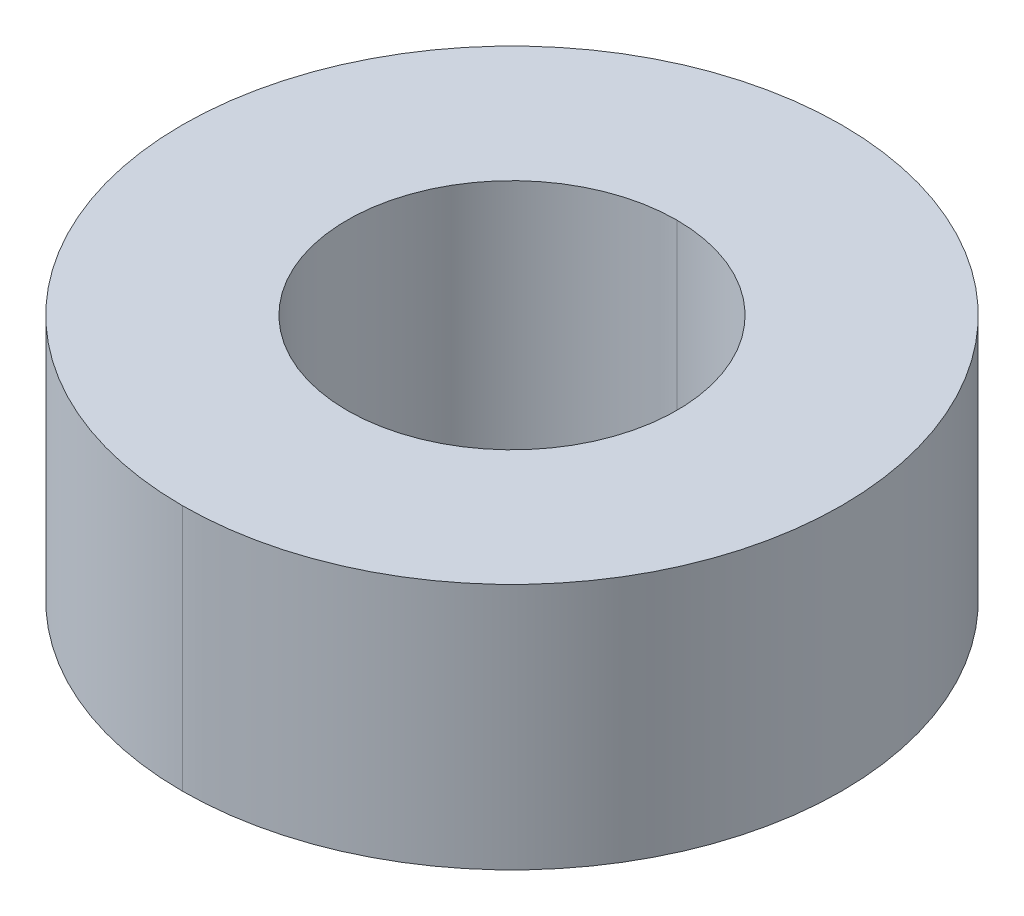
ISO-10303-21;
HEADER;
FILE_DESCRIPTION(('STEP AP214'),'2;1');
FILE_NAME('part.step','',(''),(''),'','','');
FILE_SCHEMA(('AUTOMOTIVE_DESIGN { 1 0 10303 214 1 1 1 1 }'));
ENDSEC;
DATA;
#1=APPLICATION_CONTEXT('core data for automotive mechanical design processes');
#2=APPLICATION_PROTOCOL_DEFINITION('international standard','automotive_design',2000,#1);
#3=PRODUCT_CONTEXT('',#1,'mechanical');
#4=PRODUCT('Part','Part','',(#3));
#5=PRODUCT_RELATED_PRODUCT_CATEGORY('part','',(#4));
#6=PRODUCT_DEFINITION_FORMATION('','',#4);
#7=PRODUCT_DEFINITION_CONTEXT('part definition',#1,'design');
#8=PRODUCT_DEFINITION('design','',#6,#7);
#9=PRODUCT_DEFINITION_SHAPE('','',#8);
#10=(LENGTH_UNIT() NAMED_UNIT(*) SI_UNIT(.MILLI.,.METRE.));
#11=(NAMED_UNIT(*) PLANE_ANGLE_UNIT() SI_UNIT($,.RADIAN.));
#12=(NAMED_UNIT(*) SI_UNIT($,.STERADIAN.) SOLID_ANGLE_UNIT());
#13=UNCERTAINTY_MEASURE_WITH_UNIT(LENGTH_MEASURE(1.E-05),#10,'distance_accuracy_value','');
#14=(GEOMETRIC_REPRESENTATION_CONTEXT(3) GLOBAL_UNCERTAINTY_ASSIGNED_CONTEXT((#13)) GLOBAL_UNIT_ASSIGNED_CONTEXT((#10,
#11,#12)) REPRESENTATION_CONTEXT('',''));
#15=CARTESIAN_POINT('',(0.,0.,0.));
#16=DIRECTION('',(0.,0.,1.));
#17=DIRECTION('',(1.,0.,0.));
#18=AXIS2_PLACEMENT_3D('',#15,#16,#17);
#19=CARTESIAN_POINT('',(0.,2.38125,0.));
#20=DIRECTION('',(0.,-1.,0.));
#21=DIRECTION('',(0.,0.,-1.));
#22=AXIS2_PLACEMENT_3D('',#19,#20,#21);
#23=CYLINDRICAL_SURFACE('',#22,3.175);
#24=DIRECTION('',(0.,-1.,0.));
#25=VECTOR('',#24,1.);
#26=CARTESIAN_POINT('',(0.,2.38125,3.175));
#27=LINE('',#26,#25);
#28=CARTESIAN_POINT('',(0.,2.38125,3.175));
#29=VERTEX_POINT('',#28);
#30=CARTESIAN_POINT('',(0.,-2.38125,3.175));
#31=VERTEX_POINT('',#30);
#32=EDGE_CURVE('E104',#29,#31,#27,.T.);
#33=ORIENTED_EDGE('',*,*,#32,.F.);
#34=CARTESIAN_POINT('',(0.,2.38125,0.));
#35=DIRECTION('',(0.,1.,0.));
#36=DIRECTION('',(0.,0.,1.));
#37=AXIS2_PLACEMENT_3D('',#34,#35,#36);
#38=CIRCLE('',#37,3.175);
#39=CARTESIAN_POINT('',(0.,2.38125,-3.175));
#40=VERTEX_POINT('',#39);
#41=EDGE_CURVE('E78',#29,#40,#38,.T.);
#42=ORIENTED_EDGE('',*,*,#41,.T.);
#43=DIRECTION('',(0.,-1.,0.));
#44=VECTOR('',#43,1.);
#45=CARTESIAN_POINT('',(0.,2.38125,-3.175));
#46=LINE('',#45,#44);
#47=CARTESIAN_POINT('',(0.,-2.38125,-3.175));
#48=VERTEX_POINT('',#47);
#49=EDGE_CURVE('E89',#40,#48,#46,.T.);
#50=ORIENTED_EDGE('',*,*,#49,.T.);
#51=CARTESIAN_POINT('',(0.,-2.38125,0.));
#52=DIRECTION('',(0.,1.,0.));
#53=DIRECTION('',(0.,0.,1.));
#54=AXIS2_PLACEMENT_3D('',#51,#52,#53);
#55=CIRCLE('',#54,3.175);
#56=EDGE_CURVE('E11',#31,#48,#55,.T.);
#57=ORIENTED_EDGE('',*,*,#56,.F.);
#58=EDGE_LOOP('',(#33,#42,#50,#57));
#59=FACE_BOUND('',#58,.T.);
#60=ADVANCED_FACE('F16',(#59),#23,.F.);
#61=CARTESIAN_POINT('',(0.,2.38125,0.));
#62=DIRECTION('',(0.,-1.,0.));
#63=DIRECTION('',(0.,0.,-1.));
#64=AXIS2_PLACEMENT_3D('',#61,#62,#63);
#65=CYLINDRICAL_SURFACE('',#64,6.35);
#66=DIRECTION('',(0.,-1.,0.));
#67=VECTOR('',#66,1.);
#68=CARTESIAN_POINT('',(0.,2.38125,6.35));
#69=LINE('',#68,#67);
#70=CARTESIAN_POINT('',(0.,2.38125,6.35));
#71=VERTEX_POINT('',#70);
#72=CARTESIAN_POINT('',(0.,-2.38125,6.35));
#73=VERTEX_POINT('',#72);
#74=EDGE_CURVE('E20',#71,#73,#69,.T.);
#75=ORIENTED_EDGE('',*,*,#74,.F.);
#76=CARTESIAN_POINT('',(0.,2.38125,0.));
#77=DIRECTION('',(0.,1.,0.));
#78=DIRECTION('',(0.,0.,1.));
#79=AXIS2_PLACEMENT_3D('',#76,#77,#78);
#80=CIRCLE('',#79,6.35);
#81=CARTESIAN_POINT('',(0.,2.38125,-6.35));
#82=VERTEX_POINT('',#81);
#83=EDGE_CURVE('E72',#82,#71,#80,.T.);
#84=ORIENTED_EDGE('',*,*,#83,.F.);
#85=DIRECTION('',(0.,-1.,0.));
#86=VECTOR('',#85,1.);
#87=CARTESIAN_POINT('',(0.,2.38125,-6.35));
#88=LINE('',#87,#86);
#89=CARTESIAN_POINT('',(0.,-2.38125,-6.35));
#90=VERTEX_POINT('',#89);
#91=EDGE_CURVE('E79',#82,#90,#88,.T.);
#92=ORIENTED_EDGE('',*,*,#91,.T.);
#93=CARTESIAN_POINT('',(0.,-2.38125,0.));
#94=DIRECTION('',(0.,1.,0.));
#95=DIRECTION('',(0.,0.,1.));
#96=AXIS2_PLACEMENT_3D('',#93,#94,#95);
#97=CIRCLE('',#96,6.35);
#98=EDGE_CURVE('E26',#90,#73,#97,.T.);
#99=ORIENTED_EDGE('',*,*,#98,.T.);
#100=EDGE_LOOP('',(#75,#84,#92,#99));
#101=FACE_BOUND('',#100,.T.);
#102=ADVANCED_FACE('F82',(#101),#65,.T.);
#103=CARTESIAN_POINT('',(0.,-2.38125,0.));
#104=DIRECTION('',(0.,1.,0.));
#105=DIRECTION('',(1.,0.,0.));
#106=AXIS2_PLACEMENT_3D('',#103,#104,#105);
#107=PLANE('',#106);
#108=CARTESIAN_POINT('',(0.,-2.38125,0.));
#109=DIRECTION('',(0.,1.,0.));
#110=DIRECTION('',(0.,0.,1.));
#111=AXIS2_PLACEMENT_3D('',#108,#109,#110);
#112=CIRCLE('',#111,3.175);
#113=EDGE_CURVE('E96',#48,#31,#112,.T.);
#114=ORIENTED_EDGE('',*,*,#113,.T.);
#115=ORIENTED_EDGE('',*,*,#56,.T.);
#116=EDGE_LOOP('',(#114,#115));
#117=FACE_BOUND('',#116,.T.);
#118=ORIENTED_EDGE('',*,*,#98,.F.);
#119=CARTESIAN_POINT('',(0.,-2.38125,0.));
#120=DIRECTION('',(0.,1.,0.));
#121=DIRECTION('',(0.,0.,1.));
#122=AXIS2_PLACEMENT_3D('',#119,#120,#121);
#123=CIRCLE('',#122,6.35);
#124=EDGE_CURVE('E86',#73,#90,#123,.T.);
#125=ORIENTED_EDGE('',*,*,#124,.F.);
#126=EDGE_LOOP('',(#118,#125));
#127=FACE_BOUND('',#126,.T.);
#128=ADVANCED_FACE('F127',(#117,#127),#107,.F.);
#129=CARTESIAN_POINT('',(0.,2.38125,0.));
#130=DIRECTION('',(0.,1.,0.));
#131=DIRECTION('',(1.,0.,0.));
#132=AXIS2_PLACEMENT_3D('',#129,#130,#131);
#133=PLANE('',#132);
#134=CARTESIAN_POINT('',(0.,2.38125,0.));
#135=DIRECTION('',(0.,1.,0.));
#136=DIRECTION('',(0.,0.,1.));
#137=AXIS2_PLACEMENT_3D('',#134,#135,#136);
#138=CIRCLE('',#137,3.175);
#139=EDGE_CURVE('E107',#40,#29,#138,.T.);
#140=ORIENTED_EDGE('',*,*,#139,.F.);
#141=ORIENTED_EDGE('',*,*,#41,.F.);
#142=EDGE_LOOP('',(#140,#141));
#143=FACE_BOUND('',#142,.T.);
#144=ORIENTED_EDGE('',*,*,#83,.T.);
#145=CARTESIAN_POINT('',(0.,2.38125,0.));
#146=DIRECTION('',(0.,1.,0.));
#147=DIRECTION('',(0.,0.,1.));
#148=AXIS2_PLACEMENT_3D('',#145,#146,#147);
#149=CIRCLE('',#148,6.35);
#150=EDGE_CURVE('E75',#71,#82,#149,.T.);
#151=ORIENTED_EDGE('',*,*,#150,.T.);
#152=EDGE_LOOP('',(#144,#151));
#153=FACE_BOUND('',#152,.T.);
#154=ADVANCED_FACE('F73',(#143,#153),#133,.T.);
#155=CARTESIAN_POINT('',(0.,2.38125,0.));
#156=DIRECTION('',(0.,-1.,0.));
#157=DIRECTION('',(0.,0.,-1.));
#158=AXIS2_PLACEMENT_3D('',#155,#156,#157);
#159=CYLINDRICAL_SURFACE('',#158,6.35);
#160=ORIENTED_EDGE('',*,*,#150,.F.);
#161=ORIENTED_EDGE('',*,*,#74,.T.);
#162=ORIENTED_EDGE('',*,*,#124,.T.);
#163=ORIENTED_EDGE('',*,*,#91,.F.);
#164=EDGE_LOOP('',(#160,#161,#162,#163));
#165=FACE_BOUND('',#164,.T.);
#166=ADVANCED_FACE('F87',(#165),#159,.T.);
#167=CARTESIAN_POINT('',(0.,2.38125,0.));
#168=DIRECTION('',(0.,-1.,0.));
#169=DIRECTION('',(0.,0.,-1.));
#170=AXIS2_PLACEMENT_3D('',#167,#168,#169);
#171=CYLINDRICAL_SURFACE('',#170,3.175);
#172=ORIENTED_EDGE('',*,*,#139,.T.);
#173=ORIENTED_EDGE('',*,*,#32,.T.);
#174=ORIENTED_EDGE('',*,*,#113,.F.);
#175=ORIENTED_EDGE('',*,*,#49,.F.);
#176=EDGE_LOOP('',(#172,#173,#174,#175));
#177=FACE_BOUND('',#176,.T.);
#178=ADVANCED_FACE('F18',(#177),#171,.F.);
#179=CLOSED_SHELL('',(#60,#102,#128,#154,#166,#178));
#180=MANIFOLD_SOLID_BREP('B1',#179);
#181=ADVANCED_BREP_SHAPE_REPRESENTATION('',(#18,#180),#14);
#182=SHAPE_DEFINITION_REPRESENTATION(#9,#181);
ENDSEC;
END-ISO-10303-21;
